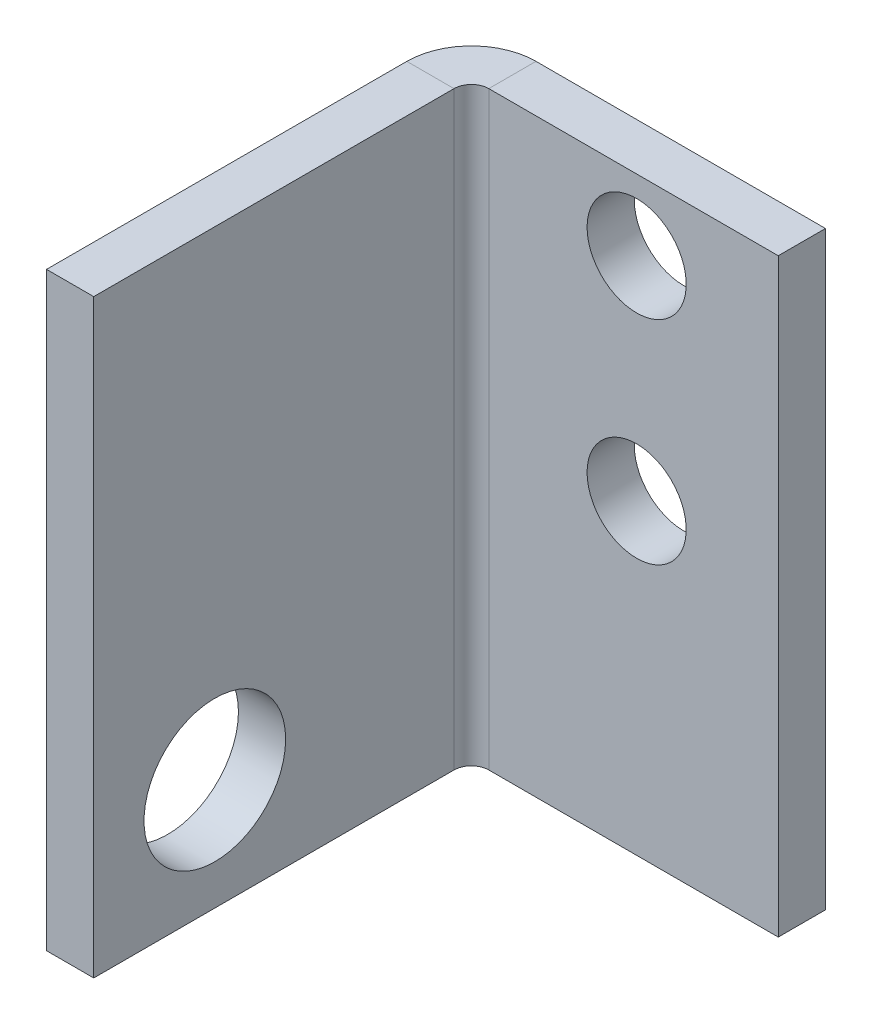
ISO-10303-21;
HEADER;
FILE_DESCRIPTION(('STEP AP214'),'2;1');
FILE_NAME('part.step','',(''),(''),'','','');
FILE_SCHEMA(('AUTOMOTIVE_DESIGN { 1 0 10303 214 1 1 1 1 }'));
ENDSEC;
DATA;
#1=APPLICATION_CONTEXT('core data for automotive mechanical design processes');
#2=APPLICATION_PROTOCOL_DEFINITION('international standard','automotive_design',2000,#1);
#3=PRODUCT_CONTEXT('',#1,'mechanical');
#4=PRODUCT('Part','Part','',(#3));
#5=PRODUCT_RELATED_PRODUCT_CATEGORY('part','',(#4));
#6=PRODUCT_DEFINITION_FORMATION('','',#4);
#7=PRODUCT_DEFINITION_CONTEXT('part definition',#1,'design');
#8=PRODUCT_DEFINITION('design','',#6,#7);
#9=PRODUCT_DEFINITION_SHAPE('','',#8);
#10=(LENGTH_UNIT() NAMED_UNIT(*) SI_UNIT(.MILLI.,.METRE.));
#11=(NAMED_UNIT(*) PLANE_ANGLE_UNIT() SI_UNIT($,.RADIAN.));
#12=(NAMED_UNIT(*) SI_UNIT($,.STERADIAN.) SOLID_ANGLE_UNIT());
#13=UNCERTAINTY_MEASURE_WITH_UNIT(LENGTH_MEASURE(1.E-05),#10,'distance_accuracy_value','');
#14=(GEOMETRIC_REPRESENTATION_CONTEXT(3) GLOBAL_UNCERTAINTY_ASSIGNED_CONTEXT((#13)) GLOBAL_UNIT_ASSIGNED_CONTEXT((#10,
#11,#12)) REPRESENTATION_CONTEXT('',''));
#15=CARTESIAN_POINT('',(0.,0.,0.));
#16=DIRECTION('',(0.,0.,1.));
#17=DIRECTION('',(1.,0.,0.));
#18=AXIS2_PLACEMENT_3D('',#15,#16,#17);
#19=CARTESIAN_POINT('',(2.,0.,-22.));
#20=DIRECTION('',(-1.,0.,0.));
#21=DIRECTION('',(0.,0.,-1.));
#22=AXIS2_PLACEMENT_3D('',#19,#20,#21);
#23=PLANE('',#22);
#24=CARTESIAN_POINT('',(2.,4.7,-9.13));
#25=DIRECTION('',(1.,0.,0.));
#26=DIRECTION('',(0.,0.,-1.));
#27=AXIS2_PLACEMENT_3D('',#24,#25,#26);
#28=CIRCLE('',#27,3.);
#29=CARTESIAN_POINT('',(2.,4.7,-12.13));
#30=VERTEX_POINT('',#29);
#31=EDGE_CURVE('E154',#30,#30,#28,.T.);
#32=ORIENTED_EDGE('',*,*,#31,.F.);
#33=EDGE_LOOP('',(#32));
#34=FACE_BOUND('',#33,.T.);
#35=DIRECTION('',(0.,-1.,0.));
#36=VECTOR('',#35,1.);
#37=CARTESIAN_POINT('',(2.,0.,-4.));
#38=LINE('',#37,#36);
#39=CARTESIAN_POINT('',(2.,25.,-4.));
#40=VERTEX_POINT('',#39);
#41=CARTESIAN_POINT('',(2.,0.,-4.));
#42=VERTEX_POINT('',#41);
#43=EDGE_CURVE('E113',#40,#42,#38,.T.);
#44=ORIENTED_EDGE('',*,*,#43,.T.);
#45=DIRECTION('',(0.,0.,1.));
#46=VECTOR('',#45,1.);
#47=CARTESIAN_POINT('',(2.,0.,-22.));
#48=LINE('',#47,#46);
#49=CARTESIAN_POINT('',(2.,0.,-19.2634));
#50=VERTEX_POINT('',#49);
#51=EDGE_CURVE('E111',#50,#42,#48,.T.);
#52=ORIENTED_EDGE('',*,*,#51,.F.);
#53=DIRECTION('',(0.,-1.,0.));
#54=VECTOR('',#53,1.);
#55=CARTESIAN_POINT('',(2.,0.,-19.2634));
#56=LINE('',#55,#54);
#57=CARTESIAN_POINT('',(2.,25.,-19.2634));
#58=VERTEX_POINT('',#57);
#59=EDGE_CURVE('E135',#50,#58,#56,.F.);
#60=ORIENTED_EDGE('',*,*,#59,.T.);
#61=DIRECTION('',(0.,0.,1.));
#62=VECTOR('',#61,1.);
#63=CARTESIAN_POINT('',(2.,25.,-22.));
#64=LINE('',#63,#62);
#65=EDGE_CURVE('E46',#58,#40,#64,.T.);
#66=ORIENTED_EDGE('',*,*,#65,.T.);
#67=EDGE_LOOP('',(#44,#52,#60,#66));
#68=FACE_BOUND('',#67,.T.);
#69=ADVANCED_FACE('F39',(#34,#68),#23,.F.);
#70=CARTESIAN_POINT('',(0.,0.,-22.));
#71=DIRECTION('',(-1.,0.,0.));
#72=DIRECTION('',(0.,0.,-1.));
#73=AXIS2_PLACEMENT_3D('',#70,#71,#72);
#74=PLANE('',#73);
#75=CARTESIAN_POINT('',(0.,4.7,-9.13));
#76=DIRECTION('',(1.,0.,0.));
#77=DIRECTION('',(0.,0.,-1.));
#78=AXIS2_PLACEMENT_3D('',#75,#76,#77);
#79=CIRCLE('',#78,3.);
#80=CARTESIAN_POINT('',(0.,4.7,-12.13));
#81=VERTEX_POINT('',#80);
#82=EDGE_CURVE('E151',#81,#81,#79,.T.);
#83=ORIENTED_EDGE('',*,*,#82,.T.);
#84=EDGE_LOOP('',(#83));
#85=FACE_BOUND('',#84,.T.);
#86=DIRECTION('',(0.,0.,1.));
#87=VECTOR('',#86,1.);
#88=CARTESIAN_POINT('',(0.,25.,-22.));
#89=LINE('',#88,#87);
#90=CARTESIAN_POINT('',(0.,25.,-19.2634));
#91=VERTEX_POINT('',#90);
#92=CARTESIAN_POINT('',(0.,25.,-4.));
#93=VERTEX_POINT('',#92);
#94=EDGE_CURVE('E124',#91,#93,#89,.T.);
#95=ORIENTED_EDGE('',*,*,#94,.F.);
#96=DIRECTION('',(0.,-1.,0.));
#97=VECTOR('',#96,1.);
#98=CARTESIAN_POINT('',(0.,0.,-19.2634));
#99=LINE('',#98,#97);
#100=CARTESIAN_POINT('',(0.,0.,-19.2634));
#101=VERTEX_POINT('',#100);
#102=EDGE_CURVE('E123',#101,#91,#99,.F.);
#103=ORIENTED_EDGE('',*,*,#102,.F.);
#104=DIRECTION('',(0.,0.,1.));
#105=VECTOR('',#104,1.);
#106=CARTESIAN_POINT('',(0.,0.,-22.));
#107=LINE('',#106,#105);
#108=CARTESIAN_POINT('',(0.,0.,-4.));
#109=VERTEX_POINT('',#108);
#110=EDGE_CURVE('E108',#101,#109,#107,.T.);
#111=ORIENTED_EDGE('',*,*,#110,.T.);
#112=DIRECTION('',(0.,1.,0.));
#113=VECTOR('',#112,1.);
#114=CARTESIAN_POINT('',(0.,0.,-4.));
#115=LINE('',#114,#113);
#116=EDGE_CURVE('E114',#109,#93,#115,.T.);
#117=ORIENTED_EDGE('',*,*,#116,.T.);
#118=EDGE_LOOP('',(#95,#103,#111,#117));
#119=FACE_BOUND('',#118,.T.);
#120=ADVANCED_FACE('F121',(#85,#119),#74,.T.);
#121=CARTESIAN_POINT('',(2.,0.,-22.));
#122=DIRECTION('',(0.,-1.,0.));
#123=DIRECTION('',(0.,0.,1.));
#124=AXIS2_PLACEMENT_3D('',#121,#122,#123);
#125=PLANE('',#124);
#126=ORIENTED_EDGE('',*,*,#110,.F.);
#127=DIRECTION('',(-1.,0.,0.));
#128=VECTOR('',#127,1.);
#129=CARTESIAN_POINT('',(2.,0.,-19.2634));
#130=LINE('',#129,#128);
#131=EDGE_CURVE('E192',#50,#101,#130,.T.);
#132=ORIENTED_EDGE('',*,*,#131,.F.);
#133=ORIENTED_EDGE('',*,*,#51,.T.);
#134=DIRECTION('',(-1.,0.,0.));
#135=VECTOR('',#134,1.);
#136=CARTESIAN_POINT('',(0.,0.,-4.));
#137=LINE('',#136,#135);
#138=EDGE_CURVE('E104',#42,#109,#137,.T.);
#139=ORIENTED_EDGE('',*,*,#138,.T.);
#140=EDGE_LOOP('',(#126,#132,#133,#139));
#141=FACE_BOUND('',#140,.T.);
#142=ADVANCED_FACE('F105',(#141),#125,.T.);
#143=CARTESIAN_POINT('',(0.,25.,-22.));
#144=DIRECTION('',(0.,1.,0.));
#145=DIRECTION('',(0.,0.,-1.));
#146=AXIS2_PLACEMENT_3D('',#143,#144,#145);
#147=PLANE('',#146);
#148=ORIENTED_EDGE('',*,*,#65,.F.);
#149=DIRECTION('',(-1.,0.,0.));
#150=VECTOR('',#149,1.);
#151=CARTESIAN_POINT('',(2.,25.,-19.2634));
#152=LINE('',#151,#150);
#153=EDGE_CURVE('E127',#58,#91,#152,.T.);
#154=ORIENTED_EDGE('',*,*,#153,.T.);
#155=ORIENTED_EDGE('',*,*,#94,.T.);
#156=DIRECTION('',(-1.,0.,0.));
#157=VECTOR('',#156,1.);
#158=CARTESIAN_POINT('',(0.,25.,-4.));
#159=LINE('',#158,#157);
#160=EDGE_CURVE('E11',#40,#93,#159,.T.);
#161=ORIENTED_EDGE('',*,*,#160,.F.);
#162=EDGE_LOOP('',(#148,#154,#155,#161));
#163=FACE_BOUND('',#162,.T.);
#164=ADVANCED_FACE('F210',(#163),#147,.T.);
#165=CARTESIAN_POINT('',(2.7366,25.,-19.2634));
#166=DIRECTION('',(0.,1.,0.));
#167=DIRECTION('',(0.,0.,-1.));
#168=AXIS2_PLACEMENT_3D('',#165,#166,#167);
#169=PLANE('',#168);
#170=DIRECTION('',(0.,0.,-1.));
#171=VECTOR('',#170,1.);
#172=CARTESIAN_POINT('',(2.7366,25.,-22.));
#173=LINE('',#172,#171);
#174=CARTESIAN_POINT('',(2.7366,25.,-20.));
#175=VERTEX_POINT('',#174);
#176=CARTESIAN_POINT('',(2.73659999999999,25.,-22.));
#177=VERTEX_POINT('',#176);
#178=EDGE_CURVE('E157',#175,#177,#173,.T.);
#179=ORIENTED_EDGE('',*,*,#178,.T.);
#180=CARTESIAN_POINT('',(2.7366,25.,-19.2634));
#181=DIRECTION('',(0.,1.,0.));
#182=DIRECTION('',(0.,0.,1.));
#183=AXIS2_PLACEMENT_3D('',#180,#181,#182);
#184=CIRCLE('',#183,2.7366);
#185=EDGE_CURVE('E59',#91,#177,#184,.F.);
#186=ORIENTED_EDGE('',*,*,#185,.F.);
#187=ORIENTED_EDGE('',*,*,#153,.F.);
#188=CARTESIAN_POINT('',(2.7366,25.,-19.2634));
#189=DIRECTION('',(0.,1.,0.));
#190=DIRECTION('',(0.,0.,1.));
#191=AXIS2_PLACEMENT_3D('',#188,#189,#190);
#192=CIRCLE('',#191,0.7366);
#193=EDGE_CURVE('E194',#58,#175,#192,.F.);
#194=ORIENTED_EDGE('',*,*,#193,.T.);
#195=EDGE_LOOP('',(#179,#186,#187,#194));
#196=FACE_BOUND('',#195,.T.);
#197=ADVANCED_FACE('F209',(#196),#169,.T.);
#198=CARTESIAN_POINT('',(2.7366,0.,-19.2634));
#199=DIRECTION('',(0.,1.,0.));
#200=DIRECTION('',(0.,0.,-1.));
#201=AXIS2_PLACEMENT_3D('',#198,#199,#200);
#202=PLANE('',#201);
#203=CARTESIAN_POINT('',(2.7366,0.,-19.2634));
#204=DIRECTION('',(0.,1.,0.));
#205=DIRECTION('',(0.,0.,1.));
#206=AXIS2_PLACEMENT_3D('',#203,#204,#205);
#207=CIRCLE('',#206,0.7366);
#208=CARTESIAN_POINT('',(2.7366,0.,-20.));
#209=VERTEX_POINT('',#208);
#210=EDGE_CURVE('E161',#209,#50,#207,.T.);
#211=ORIENTED_EDGE('',*,*,#210,.T.);
#212=ORIENTED_EDGE('',*,*,#131,.T.);
#213=CARTESIAN_POINT('',(2.7366,0.,-19.2634));
#214=DIRECTION('',(0.,1.,0.));
#215=DIRECTION('',(0.,0.,1.));
#216=AXIS2_PLACEMENT_3D('',#213,#214,#215);
#217=CIRCLE('',#216,2.7366);
#218=CARTESIAN_POINT('',(2.7366,0.,-22.));
#219=VERTEX_POINT('',#218);
#220=EDGE_CURVE('E190',#219,#101,#217,.T.);
#221=ORIENTED_EDGE('',*,*,#220,.F.);
#222=DIRECTION('',(0.,0.,-1.));
#223=VECTOR('',#222,1.);
#224=CARTESIAN_POINT('',(2.7366,0.,-20.));
#225=LINE('',#224,#223);
#226=EDGE_CURVE('E182',#209,#219,#225,.T.);
#227=ORIENTED_EDGE('',*,*,#226,.F.);
#228=EDGE_LOOP('',(#211,#212,#221,#227));
#229=FACE_BOUND('',#228,.T.);
#230=ADVANCED_FACE('F202',(#229),#202,.F.);
#231=CARTESIAN_POINT('',(2.7366,0.,-19.2634));
#232=DIRECTION('',(0.,-1.,0.));
#233=DIRECTION('',(0.,0.,-1.));
#234=AXIS2_PLACEMENT_3D('',#231,#232,#233);
#235=CYLINDRICAL_SURFACE('',#234,2.7366);
#236=ORIENTED_EDGE('',*,*,#102,.T.);
#237=ORIENTED_EDGE('',*,*,#185,.T.);
#238=DIRECTION('',(0.,-1.,0.));
#239=VECTOR('',#238,1.);
#240=CARTESIAN_POINT('',(2.7366,0.,-22.));
#241=LINE('',#240,#239);
#242=EDGE_CURVE('E179',#177,#219,#241,.T.);
#243=ORIENTED_EDGE('',*,*,#242,.T.);
#244=ORIENTED_EDGE('',*,*,#220,.T.);
#245=EDGE_LOOP('',(#236,#237,#243,#244));
#246=FACE_BOUND('',#245,.T.);
#247=ADVANCED_FACE('F212',(#246),#235,.T.);
#248=CARTESIAN_POINT('',(2.7366,0.,-19.2634));
#249=DIRECTION('',(0.,-1.,0.));
#250=DIRECTION('',(0.,0.,-1.));
#251=AXIS2_PLACEMENT_3D('',#248,#249,#250);
#252=CYLINDRICAL_SURFACE('',#251,0.7366);
#253=ORIENTED_EDGE('',*,*,#59,.F.);
#254=ORIENTED_EDGE('',*,*,#210,.F.);
#255=DIRECTION('',(0.,1.,0.));
#256=VECTOR('',#255,1.);
#257=CARTESIAN_POINT('',(2.7366,25.,-20.));
#258=LINE('',#257,#256);
#259=EDGE_CURVE('E185',#175,#209,#258,.F.);
#260=ORIENTED_EDGE('',*,*,#259,.F.);
#261=ORIENTED_EDGE('',*,*,#193,.F.);
#262=EDGE_LOOP('',(#253,#254,#260,#261));
#263=FACE_BOUND('',#262,.T.);
#264=ADVANCED_FACE('F206',(#263),#252,.F.);
#265=CARTESIAN_POINT('',(1.99999999999999,0.,-22.));
#266=DIRECTION('',(0.,-1.,0.));
#267=DIRECTION('',(0.,0.,1.));
#268=AXIS2_PLACEMENT_3D('',#265,#266,#267);
#269=PLANE('',#268);
#270=DIRECTION('',(-1.,0.,0.));
#271=VECTOR('',#270,1.);
#272=CARTESIAN_POINT('',(1.99999999999999,0.,-22.));
#273=LINE('',#272,#271);
#274=CARTESIAN_POINT('',(15.,0.,-22.));
#275=VERTEX_POINT('',#274);
#276=EDGE_CURVE('E165',#275,#219,#273,.T.);
#277=ORIENTED_EDGE('',*,*,#276,.F.);
#278=DIRECTION('',(0.,0.,1.));
#279=VECTOR('',#278,1.);
#280=CARTESIAN_POINT('',(15.,0.,-22.));
#281=LINE('',#280,#279);
#282=CARTESIAN_POINT('',(15.,0.,-20.));
#283=VERTEX_POINT('',#282);
#284=EDGE_CURVE('E158',#275,#283,#281,.T.);
#285=ORIENTED_EDGE('',*,*,#284,.T.);
#286=DIRECTION('',(1.,0.,0.));
#287=VECTOR('',#286,1.);
#288=CARTESIAN_POINT('',(0.,0.,-20.));
#289=LINE('',#288,#287);
#290=EDGE_CURVE('E172',#283,#209,#289,.F.);
#291=ORIENTED_EDGE('',*,*,#290,.T.);
#292=ORIENTED_EDGE('',*,*,#226,.T.);
#293=EDGE_LOOP('',(#277,#285,#291,#292));
#294=FACE_BOUND('',#293,.T.);
#295=ADVANCED_FACE('F217',(#294),#269,.T.);
#296=CARTESIAN_POINT('',(15.,25.,-22.));
#297=DIRECTION('',(0.,1.,0.));
#298=DIRECTION('',(0.,0.,-1.));
#299=AXIS2_PLACEMENT_3D('',#296,#297,#298);
#300=PLANE('',#299);
#301=DIRECTION('',(-1.,0.,0.));
#302=VECTOR('',#301,1.);
#303=CARTESIAN_POINT('',(0.,25.,-20.));
#304=LINE('',#303,#302);
#305=CARTESIAN_POINT('',(15.,25.,-20.));
#306=VERTEX_POINT('',#305);
#307=EDGE_CURVE('E176',#175,#306,#304,.F.);
#308=ORIENTED_EDGE('',*,*,#307,.T.);
#309=DIRECTION('',(0.,0.,1.));
#310=VECTOR('',#309,1.);
#311=CARTESIAN_POINT('',(15.,25.,-22.));
#312=LINE('',#311,#310);
#313=CARTESIAN_POINT('',(15.,25.,-22.));
#314=VERTEX_POINT('',#313);
#315=EDGE_CURVE('E162',#314,#306,#312,.T.);
#316=ORIENTED_EDGE('',*,*,#315,.F.);
#317=DIRECTION('',(1.,0.,0.));
#318=VECTOR('',#317,1.);
#319=CARTESIAN_POINT('',(15.,25.,-22.));
#320=LINE('',#319,#318);
#321=EDGE_CURVE('E169',#177,#314,#320,.T.);
#322=ORIENTED_EDGE('',*,*,#321,.F.);
#323=ORIENTED_EDGE('',*,*,#178,.F.);
#324=EDGE_LOOP('',(#308,#316,#322,#323));
#325=FACE_BOUND('',#324,.T.);
#326=ADVANCED_FACE('F224',(#325),#300,.T.);
#327=CARTESIAN_POINT('',(0.,0.,-22.));
#328=DIRECTION('',(0.,0.,-1.));
#329=DIRECTION('',(1.,0.,0.));
#330=AXIS2_PLACEMENT_3D('',#327,#328,#329);
#331=PLANE('',#330);
#332=CARTESIAN_POINT('',(9.,22.,-22.));
#333=DIRECTION('',(0.,0.,1.));
#334=DIRECTION('',(1.,0.,0.));
#335=AXIS2_PLACEMENT_3D('',#332,#333,#334);
#336=CIRCLE('',#335,2.1);
#337=CARTESIAN_POINT('',(11.1,22.,-22.));
#338=VERTEX_POINT('',#337);
#339=EDGE_CURVE('E140',#338,#338,#336,.T.);
#340=ORIENTED_EDGE('',*,*,#339,.T.);
#341=EDGE_LOOP('',(#340));
#342=FACE_BOUND('',#341,.T.);
#343=CARTESIAN_POINT('',(9.,13.,-22.));
#344=DIRECTION('',(0.,0.,1.));
#345=DIRECTION('',(1.,0.,0.));
#346=AXIS2_PLACEMENT_3D('',#343,#344,#345);
#347=CIRCLE('',#346,2.1);
#348=CARTESIAN_POINT('',(11.1,13.,-22.));
#349=VERTEX_POINT('',#348);
#350=EDGE_CURVE('E148',#349,#349,#347,.T.);
#351=ORIENTED_EDGE('',*,*,#350,.T.);
#352=EDGE_LOOP('',(#351));
#353=FACE_BOUND('',#352,.T.);
#354=ORIENTED_EDGE('',*,*,#321,.T.);
#355=DIRECTION('',(0.,-1.,0.));
#356=VECTOR('',#355,1.);
#357=CARTESIAN_POINT('',(15.,0.,-22.));
#358=LINE('',#357,#356);
#359=EDGE_CURVE('E167',#314,#275,#358,.T.);
#360=ORIENTED_EDGE('',*,*,#359,.T.);
#361=ORIENTED_EDGE('',*,*,#276,.T.);
#362=ORIENTED_EDGE('',*,*,#242,.F.);
#363=EDGE_LOOP('',(#354,#360,#361,#362));
#364=FACE_BOUND('',#363,.T.);
#365=ADVANCED_FACE('F225',(#342,#353,#364),#331,.T.);
#366=CARTESIAN_POINT('',(0.,0.,-20.));
#367=DIRECTION('',(0.,0.,-1.));
#368=DIRECTION('',(1.,0.,0.));
#369=AXIS2_PLACEMENT_3D('',#366,#367,#368);
#370=PLANE('',#369);
#371=CARTESIAN_POINT('',(9.00000000000001,22.,-20.));
#372=DIRECTION('',(0.,0.,-1.));
#373=DIRECTION('',(-1.,0.,0.));
#374=AXIS2_PLACEMENT_3D('',#371,#372,#373);
#375=CIRCLE('',#374,2.1);
#376=CARTESIAN_POINT('',(6.9,22.,-20.));
#377=VERTEX_POINT('',#376);
#378=EDGE_CURVE('E137',#377,#377,#375,.T.);
#379=ORIENTED_EDGE('',*,*,#378,.T.);
#380=EDGE_LOOP('',(#379));
#381=FACE_BOUND('',#380,.T.);
#382=CARTESIAN_POINT('',(9.00000000000001,13.,-20.));
#383=DIRECTION('',(0.,0.,-1.));
#384=DIRECTION('',(-1.,0.,0.));
#385=AXIS2_PLACEMENT_3D('',#382,#383,#384);
#386=CIRCLE('',#385,2.1);
#387=CARTESIAN_POINT('',(6.9,13.,-20.));
#388=VERTEX_POINT('',#387);
#389=EDGE_CURVE('E145',#388,#388,#386,.T.);
#390=ORIENTED_EDGE('',*,*,#389,.T.);
#391=EDGE_LOOP('',(#390));
#392=FACE_BOUND('',#391,.T.);
#393=ORIENTED_EDGE('',*,*,#259,.T.);
#394=ORIENTED_EDGE('',*,*,#290,.F.);
#395=DIRECTION('',(0.,1.,0.));
#396=VECTOR('',#395,1.);
#397=CARTESIAN_POINT('',(15.,0.,-20.));
#398=LINE('',#397,#396);
#399=EDGE_CURVE('E174',#306,#283,#398,.F.);
#400=ORIENTED_EDGE('',*,*,#399,.F.);
#401=ORIENTED_EDGE('',*,*,#307,.F.);
#402=EDGE_LOOP('',(#393,#394,#400,#401));
#403=FACE_BOUND('',#402,.T.);
#404=ADVANCED_FACE('F221',(#381,#392,#403),#370,.F.);
#405=CARTESIAN_POINT('',(15.,0.,-22.));
#406=DIRECTION('',(1.,0.,0.));
#407=DIRECTION('',(0.,0.,1.));
#408=AXIS2_PLACEMENT_3D('',#405,#406,#407);
#409=PLANE('',#408);
#410=ORIENTED_EDGE('',*,*,#399,.T.);
#411=ORIENTED_EDGE('',*,*,#284,.F.);
#412=ORIENTED_EDGE('',*,*,#359,.F.);
#413=ORIENTED_EDGE('',*,*,#315,.T.);
#414=EDGE_LOOP('',(#410,#411,#412,#413));
#415=FACE_BOUND('',#414,.T.);
#416=ADVANCED_FACE('F227',(#415),#409,.T.);
#417=CARTESIAN_POINT('',(10.,4.7,-9.13));
#418=DIRECTION('',(-1.,0.,0.));
#419=DIRECTION('',(0.,0.,-1.));
#420=AXIS2_PLACEMENT_3D('',#417,#418,#419);
#421=CYLINDRICAL_SURFACE('',#420,3.);
#422=ORIENTED_EDGE('',*,*,#82,.F.);
#423=EDGE_LOOP('',(#422));
#424=FACE_BOUND('',#423,.T.);
#425=ORIENTED_EDGE('',*,*,#31,.T.);
#426=EDGE_LOOP('',(#425));
#427=FACE_BOUND('',#426,.T.);
#428=ADVANCED_FACE('F229',(#424,#427),#421,.F.);
#429=CARTESIAN_POINT('',(8.99999999999997,13.,-30.));
#430=DIRECTION('',(0.,0.,1.));
#431=DIRECTION('',(-1.,0.,0.));
#432=AXIS2_PLACEMENT_3D('',#429,#430,#431);
#433=CYLINDRICAL_SURFACE('',#432,2.1);
#434=ORIENTED_EDGE('',*,*,#350,.F.);
#435=EDGE_LOOP('',(#434));
#436=FACE_BOUND('',#435,.T.);
#437=ORIENTED_EDGE('',*,*,#389,.F.);
#438=EDGE_LOOP('',(#437));
#439=FACE_BOUND('',#438,.T.);
#440=ADVANCED_FACE('F235',(#436,#439),#433,.F.);
#441=CARTESIAN_POINT('',(8.99999999999997,22.,-30.));
#442=DIRECTION('',(0.,0.,1.));
#443=DIRECTION('',(-1.,0.,0.));
#444=AXIS2_PLACEMENT_3D('',#441,#442,#443);
#445=CYLINDRICAL_SURFACE('',#444,2.1);
#446=ORIENTED_EDGE('',*,*,#339,.F.);
#447=EDGE_LOOP('',(#446));
#448=FACE_BOUND('',#447,.T.);
#449=ORIENTED_EDGE('',*,*,#378,.F.);
#450=EDGE_LOOP('',(#449));
#451=FACE_BOUND('',#450,.T.);
#452=ADVANCED_FACE('F280',(#448,#451),#445,.F.);
#453=CARTESIAN_POINT('',(0.,0.,-4.));
#454=DIRECTION('',(0.,0.,1.));
#455=DIRECTION('',(-1.,0.,0.));
#456=AXIS2_PLACEMENT_3D('',#453,#454,#455);
#457=PLANE('',#456);
#458=ORIENTED_EDGE('',*,*,#43,.F.);
#459=ORIENTED_EDGE('',*,*,#160,.T.);
#460=ORIENTED_EDGE('',*,*,#116,.F.);
#461=ORIENTED_EDGE('',*,*,#138,.F.);
#462=EDGE_LOOP('',(#458,#459,#460,#461));
#463=FACE_BOUND('',#462,.T.);
#464=ADVANCED_FACE('F116',(#463),#457,.T.);
#465=CLOSED_SHELL('',(#69,#120,#142,#164,#197,#230,#247,#264,#295,#326,#365,#404,#416,#428,#440,
#452,#464));
#466=MANIFOLD_SOLID_BREP('B2',#465);
#467=ADVANCED_BREP_SHAPE_REPRESENTATION('',(#18,#466),#14);
#468=SHAPE_DEFINITION_REPRESENTATION(#9,#467);
ENDSEC;
END-ISO-10303-21;
